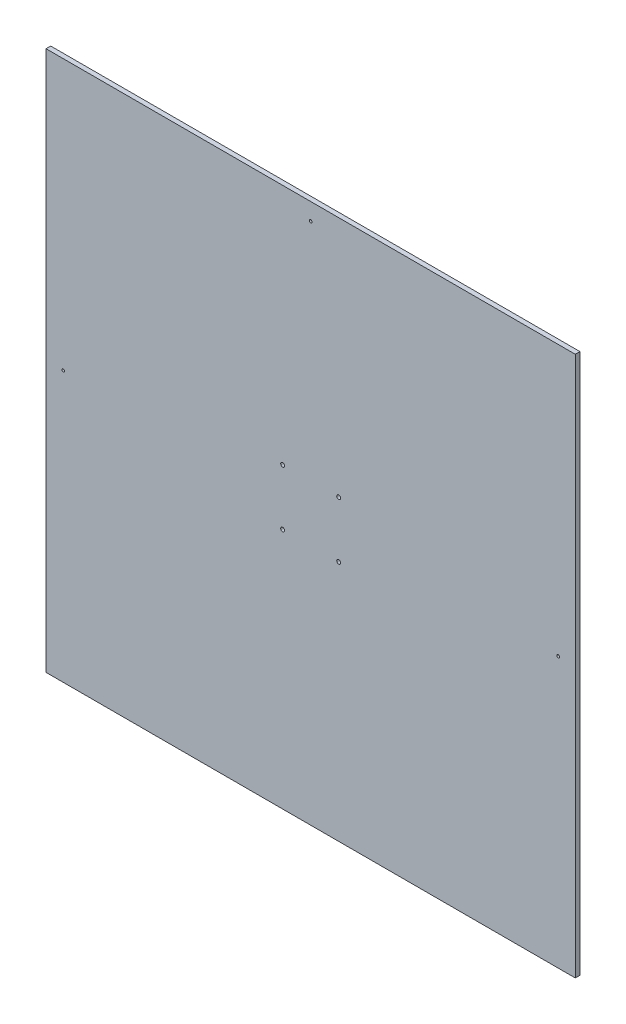
ISO-10303-21;
HEADER;
FILE_DESCRIPTION(('STEP AP214'),'2;1');
FILE_NAME('part.step','',(''),(''),'','','');
FILE_SCHEMA(('AUTOMOTIVE_DESIGN { 1 0 10303 214 1 1 1 1 }'));
ENDSEC;
DATA;
#1=APPLICATION_CONTEXT('core data for automotive mechanical design processes');
#2=APPLICATION_PROTOCOL_DEFINITION('international standard','automotive_design',2000,#1);
#3=PRODUCT_CONTEXT('',#1,'mechanical');
#4=PRODUCT('Part','Part','',(#3));
#5=PRODUCT_RELATED_PRODUCT_CATEGORY('part','',(#4));
#6=PRODUCT_DEFINITION_FORMATION('','',#4);
#7=PRODUCT_DEFINITION_CONTEXT('part definition',#1,'design');
#8=PRODUCT_DEFINITION('design','',#6,#7);
#9=PRODUCT_DEFINITION_SHAPE('','',#8);
#10=(LENGTH_UNIT() NAMED_UNIT(*) SI_UNIT(.MILLI.,.METRE.));
#11=(NAMED_UNIT(*) PLANE_ANGLE_UNIT() SI_UNIT($,.RADIAN.));
#12=(NAMED_UNIT(*) SI_UNIT($,.STERADIAN.) SOLID_ANGLE_UNIT());
#13=UNCERTAINTY_MEASURE_WITH_UNIT(LENGTH_MEASURE(1.E-05),#10,'distance_accuracy_value','');
#14=(GEOMETRIC_REPRESENTATION_CONTEXT(3) GLOBAL_UNCERTAINTY_ASSIGNED_CONTEXT((#13)) GLOBAL_UNIT_ASSIGNED_CONTEXT((#10,
#11,#12)) REPRESENTATION_CONTEXT('',''));
#15=CARTESIAN_POINT('',(0.,0.,0.));
#16=DIRECTION('',(0.,0.,1.));
#17=DIRECTION('',(1.,0.,0.));
#18=AXIS2_PLACEMENT_3D('',#15,#16,#17);
#19=CARTESIAN_POINT('',(0.,0.,6.));
#20=DIRECTION('',(0.,0.,-1.));
#21=DIRECTION('',(-1.,0.,0.));
#22=AXIS2_PLACEMENT_3D('',#19,#20,#21);
#23=PLANE('',#22);
#24=CARTESIAN_POINT('',(-318.,0.,6.));
#25=DIRECTION('',(0.,0.,1.));
#26=DIRECTION('',(1.,0.,0.));
#27=AXIS2_PLACEMENT_3D('',#24,#25,#26);
#28=CIRCLE('',#27,1.74999999999998);
#29=CARTESIAN_POINT('',(-316.25,0.,6.));
#30=VERTEX_POINT('',#29);
#31=EDGE_CURVE('E142',#30,#30,#28,.T.);
#32=ORIENTED_EDGE('',*,*,#31,.F.);
#33=EDGE_LOOP('',(#32));
#34=FACE_BOUND('',#33,.T.);
#35=CARTESIAN_POINT('',(-36.,-36.,6.));
#36=DIRECTION('',(0.,0.,1.));
#37=DIRECTION('',(1.,0.,0.));
#38=AXIS2_PLACEMENT_3D('',#35,#36,#37);
#39=CIRCLE('',#38,2.5);
#40=CARTESIAN_POINT('',(-33.5,-36.,6.));
#41=VERTEX_POINT('',#40);
#42=EDGE_CURVE('E130',#41,#41,#39,.T.);
#43=ORIENTED_EDGE('',*,*,#42,.F.);
#44=EDGE_LOOP('',(#43));
#45=FACE_BOUND('',#44,.T.);
#46=CARTESIAN_POINT('',(0.,325.,6.));
#47=DIRECTION('',(0.,0.,1.));
#48=DIRECTION('',(1.,0.,0.));
#49=AXIS2_PLACEMENT_3D('',#46,#47,#48);
#50=CIRCLE('',#49,1.75);
#51=CARTESIAN_POINT('',(1.75,325.,6.));
#52=VERTEX_POINT('',#51);
#53=EDGE_CURVE('E154',#52,#52,#50,.T.);
#54=ORIENTED_EDGE('',*,*,#53,.F.);
#55=EDGE_LOOP('',(#54));
#56=FACE_BOUND('',#55,.T.);
#57=CARTESIAN_POINT('',(-36.,36.,6.));
#58=DIRECTION('',(0.,0.,1.));
#59=DIRECTION('',(1.,0.,0.));
#60=AXIS2_PLACEMENT_3D('',#57,#58,#59);
#61=CIRCLE('',#60,2.5);
#62=CARTESIAN_POINT('',(-33.5,36.,6.));
#63=VERTEX_POINT('',#62);
#64=EDGE_CURVE('E112',#63,#63,#61,.T.);
#65=ORIENTED_EDGE('',*,*,#64,.F.);
#66=EDGE_LOOP('',(#65));
#67=FACE_BOUND('',#66,.T.);
#68=DIRECTION('',(0.,-1.,0.));
#69=VECTOR('',#68,1.);
#70=CARTESIAN_POINT('',(-340.,347.,6.));
#71=LINE('',#70,#69);
#72=CARTESIAN_POINT('',(-340.,347.,6.));
#73=VERTEX_POINT('',#72);
#74=CARTESIAN_POINT('',(-340.,-347.,6.));
#75=VERTEX_POINT('',#74);
#76=EDGE_CURVE('E97',#73,#75,#71,.T.);
#77=ORIENTED_EDGE('',*,*,#76,.T.);
#78=DIRECTION('',(1.,0.,0.));
#79=VECTOR('',#78,1.);
#80=CARTESIAN_POINT('',(340.,-347.,6.));
#81=LINE('',#80,#79);
#82=CARTESIAN_POINT('',(340.,-347.,6.));
#83=VERTEX_POINT('',#82);
#84=EDGE_CURVE('E92',#75,#83,#81,.T.);
#85=ORIENTED_EDGE('',*,*,#84,.T.);
#86=DIRECTION('',(0.,1.,0.));
#87=VECTOR('',#86,1.);
#88=CARTESIAN_POINT('',(340.,347.,6.));
#89=LINE('',#88,#87);
#90=CARTESIAN_POINT('',(340.,347.,6.));
#91=VERTEX_POINT('',#90);
#92=EDGE_CURVE('E95',#83,#91,#89,.T.);
#93=ORIENTED_EDGE('',*,*,#92,.T.);
#94=DIRECTION('',(-1.,0.,0.));
#95=VECTOR('',#94,1.);
#96=CARTESIAN_POINT('',(340.,347.,6.));
#97=LINE('',#96,#95);
#98=EDGE_CURVE('E62',#91,#73,#97,.T.);
#99=ORIENTED_EDGE('',*,*,#98,.T.);
#100=EDGE_LOOP('',(#77,#85,#93,#99));
#101=FACE_BOUND('',#100,.T.);
#102=CARTESIAN_POINT('',(318.,0.,6.));
#103=DIRECTION('',(0.,0.,-1.));
#104=DIRECTION('',(-1.,0.,0.));
#105=AXIS2_PLACEMENT_3D('',#102,#103,#104);
#106=CIRCLE('',#105,1.74999999999998);
#107=CARTESIAN_POINT('',(316.25,0.,6.));
#108=VERTEX_POINT('',#107);
#109=EDGE_CURVE('E146',#108,#108,#106,.T.);
#110=ORIENTED_EDGE('',*,*,#109,.T.);
#111=EDGE_LOOP('',(#110));
#112=FACE_BOUND('',#111,.T.);
#113=CARTESIAN_POINT('',(36.,36.,6.));
#114=DIRECTION('',(0.,0.,-1.));
#115=DIRECTION('',(-1.,0.,0.));
#116=AXIS2_PLACEMENT_3D('',#113,#114,#115);
#117=CIRCLE('',#116,2.5);
#118=CARTESIAN_POINT('',(33.5,36.,6.));
#119=VERTEX_POINT('',#118);
#120=EDGE_CURVE('E127',#119,#119,#117,.T.);
#121=ORIENTED_EDGE('',*,*,#120,.T.);
#122=EDGE_LOOP('',(#121));
#123=FACE_BOUND('',#122,.T.);
#124=CARTESIAN_POINT('',(36.,-36.,6.));
#125=DIRECTION('',(0.,0.,-1.));
#126=DIRECTION('',(-1.,0.,0.));
#127=AXIS2_PLACEMENT_3D('',#124,#125,#126);
#128=CIRCLE('',#127,2.5);
#129=CARTESIAN_POINT('',(33.5,-36.,6.));
#130=VERTEX_POINT('',#129);
#131=EDGE_CURVE('E134',#130,#130,#128,.T.);
#132=ORIENTED_EDGE('',*,*,#131,.T.);
#133=EDGE_LOOP('',(#132));
#134=FACE_BOUND('',#133,.T.);
#135=ADVANCED_FACE('F45',(#34,#45,#56,#67,#101,#112,#123,#134),#23,.F.);
#136=CARTESIAN_POINT('',(0.,0.,0.));
#137=DIRECTION('',(0.,0.,-1.));
#138=DIRECTION('',(-1.,0.,0.));
#139=AXIS2_PLACEMENT_3D('',#136,#137,#138);
#140=PLANE('',#139);
#141=CARTESIAN_POINT('',(-318.,0.,0.));
#142=DIRECTION('',(0.,0.,-1.));
#143=DIRECTION('',(-1.,0.,0.));
#144=AXIS2_PLACEMENT_3D('',#141,#142,#143);
#145=CIRCLE('',#144,1.74999999999998);
#146=CARTESIAN_POINT('',(-319.75,0.,0.));
#147=VERTEX_POINT('',#146);
#148=EDGE_CURVE('E145',#147,#147,#145,.F.);
#149=ORIENTED_EDGE('',*,*,#148,.T.);
#150=EDGE_LOOP('',(#149));
#151=FACE_BOUND('',#150,.T.);
#152=CARTESIAN_POINT('',(36.,36.,0.));
#153=DIRECTION('',(0.,0.,-1.));
#154=DIRECTION('',(-1.,0.,0.));
#155=AXIS2_PLACEMENT_3D('',#152,#153,#154);
#156=CIRCLE('',#155,2.5);
#157=CARTESIAN_POINT('',(33.5,36.,0.));
#158=VERTEX_POINT('',#157);
#159=EDGE_CURVE('E137',#158,#158,#156,.T.);
#160=ORIENTED_EDGE('',*,*,#159,.F.);
#161=EDGE_LOOP('',(#160));
#162=FACE_BOUND('',#161,.T.);
#163=DIRECTION('',(0.,-1.,0.));
#164=VECTOR('',#163,1.);
#165=CARTESIAN_POINT('',(-340.,347.,0.));
#166=LINE('',#165,#164);
#167=CARTESIAN_POINT('',(-340.,347.,0.));
#168=VERTEX_POINT('',#167);
#169=CARTESIAN_POINT('',(-340.,-347.,0.));
#170=VERTEX_POINT('',#169);
#171=EDGE_CURVE('E109',#168,#170,#166,.T.);
#172=ORIENTED_EDGE('',*,*,#171,.F.);
#173=DIRECTION('',(-1.,0.,0.));
#174=VECTOR('',#173,1.);
#175=CARTESIAN_POINT('',(340.,347.,0.));
#176=LINE('',#175,#174);
#177=CARTESIAN_POINT('',(340.,347.,0.));
#178=VERTEX_POINT('',#177);
#179=EDGE_CURVE('E85',#178,#168,#176,.T.);
#180=ORIENTED_EDGE('',*,*,#179,.F.);
#181=DIRECTION('',(0.,1.,0.));
#182=VECTOR('',#181,1.);
#183=CARTESIAN_POINT('',(340.,347.,0.));
#184=LINE('',#183,#182);
#185=CARTESIAN_POINT('',(340.,-347.,0.));
#186=VERTEX_POINT('',#185);
#187=EDGE_CURVE('E79',#186,#178,#184,.T.);
#188=ORIENTED_EDGE('',*,*,#187,.F.);
#189=DIRECTION('',(1.,0.,0.));
#190=VECTOR('',#189,1.);
#191=CARTESIAN_POINT('',(340.,-347.,0.));
#192=LINE('',#191,#190);
#193=EDGE_CURVE('E101',#170,#186,#192,.T.);
#194=ORIENTED_EDGE('',*,*,#193,.F.);
#195=EDGE_LOOP('',(#172,#180,#188,#194));
#196=FACE_BOUND('',#195,.T.);
#197=CARTESIAN_POINT('',(-36.,36.,0.));
#198=DIRECTION('',(0.,0.,-1.));
#199=DIRECTION('',(-1.,0.,0.));
#200=AXIS2_PLACEMENT_3D('',#197,#198,#199);
#201=CIRCLE('',#200,2.5);
#202=CARTESIAN_POINT('',(-38.5,36.,0.));
#203=VERTEX_POINT('',#202);
#204=EDGE_CURVE('E124',#203,#203,#201,.F.);
#205=ORIENTED_EDGE('',*,*,#204,.T.);
#206=EDGE_LOOP('',(#205));
#207=FACE_BOUND('',#206,.T.);
#208=CARTESIAN_POINT('',(0.,325.,0.));
#209=DIRECTION('',(0.,0.,-1.));
#210=DIRECTION('',(-1.,0.,0.));
#211=AXIS2_PLACEMENT_3D('',#208,#209,#210);
#212=CIRCLE('',#211,1.75);
#213=CARTESIAN_POINT('',(-1.75,325.,0.));
#214=VERTEX_POINT('',#213);
#215=EDGE_CURVE('E157',#214,#214,#212,.F.);
#216=ORIENTED_EDGE('',*,*,#215,.T.);
#217=EDGE_LOOP('',(#216));
#218=FACE_BOUND('',#217,.T.);
#219=CARTESIAN_POINT('',(318.,0.,0.));
#220=DIRECTION('',(0.,0.,-1.));
#221=DIRECTION('',(-1.,0.,0.));
#222=AXIS2_PLACEMENT_3D('',#219,#220,#221);
#223=CIRCLE('',#222,1.74999999999998);
#224=CARTESIAN_POINT('',(316.25,0.,0.));
#225=VERTEX_POINT('',#224);
#226=EDGE_CURVE('E160',#225,#225,#223,.T.);
#227=ORIENTED_EDGE('',*,*,#226,.F.);
#228=EDGE_LOOP('',(#227));
#229=FACE_BOUND('',#228,.T.);
#230=CARTESIAN_POINT('',(-36.,-36.,0.));
#231=DIRECTION('',(0.,0.,-1.));
#232=DIRECTION('',(-1.,0.,0.));
#233=AXIS2_PLACEMENT_3D('',#230,#231,#232);
#234=CIRCLE('',#233,2.5);
#235=CARTESIAN_POINT('',(-38.5,-36.,0.));
#236=VERTEX_POINT('',#235);
#237=EDGE_CURVE('E133',#236,#236,#234,.F.);
#238=ORIENTED_EDGE('',*,*,#237,.T.);
#239=EDGE_LOOP('',(#238));
#240=FACE_BOUND('',#239,.T.);
#241=CARTESIAN_POINT('',(36.,-36.,0.));
#242=DIRECTION('',(0.,0.,-1.));
#243=DIRECTION('',(-1.,0.,0.));
#244=AXIS2_PLACEMENT_3D('',#241,#242,#243);
#245=CIRCLE('',#244,2.5);
#246=CARTESIAN_POINT('',(33.5,-36.,0.));
#247=VERTEX_POINT('',#246);
#248=EDGE_CURVE('E149',#247,#247,#245,.T.);
#249=ORIENTED_EDGE('',*,*,#248,.F.);
#250=EDGE_LOOP('',(#249));
#251=FACE_BOUND('',#250,.T.);
#252=ADVANCED_FACE('F120',(#151,#162,#196,#207,#218,#229,#240,#251),#140,.T.);
#253=CARTESIAN_POINT('',(-340.,347.,6.));
#254=DIRECTION('',(1.,0.,0.));
#255=DIRECTION('',(0.,1.,0.));
#256=AXIS2_PLACEMENT_3D('',#253,#254,#255);
#257=PLANE('',#256);
#258=ORIENTED_EDGE('',*,*,#171,.T.);
#259=DIRECTION('',(0.,0.,-1.));
#260=VECTOR('',#259,1.);
#261=CARTESIAN_POINT('',(-340.,-347.,6.));
#262=LINE('',#261,#260);
#263=EDGE_CURVE('E11',#75,#170,#262,.T.);
#264=ORIENTED_EDGE('',*,*,#263,.F.);
#265=ORIENTED_EDGE('',*,*,#76,.F.);
#266=DIRECTION('',(0.,0.,-1.));
#267=VECTOR('',#266,1.);
#268=CARTESIAN_POINT('',(-340.,347.,6.));
#269=LINE('',#268,#267);
#270=EDGE_CURVE('E105',#73,#168,#269,.T.);
#271=ORIENTED_EDGE('',*,*,#270,.T.);
#272=EDGE_LOOP('',(#258,#264,#265,#271));
#273=FACE_BOUND('',#272,.T.);
#274=ADVANCED_FACE('F47',(#273),#257,.F.);
#275=CARTESIAN_POINT('',(340.,-347.,6.));
#276=DIRECTION('',(0.,1.,0.));
#277=DIRECTION('',(-1.,0.,0.));
#278=AXIS2_PLACEMENT_3D('',#275,#276,#277);
#279=PLANE('',#278);
#280=ORIENTED_EDGE('',*,*,#193,.T.);
#281=DIRECTION('',(0.,0.,-1.));
#282=VECTOR('',#281,1.);
#283=CARTESIAN_POINT('',(340.,-347.,6.));
#284=LINE('',#283,#282);
#285=EDGE_CURVE('E54',#83,#186,#284,.T.);
#286=ORIENTED_EDGE('',*,*,#285,.F.);
#287=ORIENTED_EDGE('',*,*,#84,.F.);
#288=ORIENTED_EDGE('',*,*,#263,.T.);
#289=EDGE_LOOP('',(#280,#286,#287,#288));
#290=FACE_BOUND('',#289,.T.);
#291=ADVANCED_FACE('F100',(#290),#279,.F.);
#292=CARTESIAN_POINT('',(340.,347.,6.));
#293=DIRECTION('',(-1.,0.,0.));
#294=DIRECTION('',(0.,-1.,0.));
#295=AXIS2_PLACEMENT_3D('',#292,#293,#294);
#296=PLANE('',#295);
#297=ORIENTED_EDGE('',*,*,#187,.T.);
#298=DIRECTION('',(0.,0.,-1.));
#299=VECTOR('',#298,1.);
#300=CARTESIAN_POINT('',(340.,347.,6.));
#301=LINE('',#300,#299);
#302=EDGE_CURVE('E102',#91,#178,#301,.T.);
#303=ORIENTED_EDGE('',*,*,#302,.F.);
#304=ORIENTED_EDGE('',*,*,#92,.F.);
#305=ORIENTED_EDGE('',*,*,#285,.T.);
#306=EDGE_LOOP('',(#297,#303,#304,#305));
#307=FACE_BOUND('',#306,.T.);
#308=ADVANCED_FACE('F103',(#307),#296,.F.);
#309=CARTESIAN_POINT('',(340.,347.,6.));
#310=DIRECTION('',(0.,-1.,0.));
#311=DIRECTION('',(1.,0.,0.));
#312=AXIS2_PLACEMENT_3D('',#309,#310,#311);
#313=PLANE('',#312);
#314=ORIENTED_EDGE('',*,*,#179,.T.);
#315=ORIENTED_EDGE('',*,*,#270,.F.);
#316=ORIENTED_EDGE('',*,*,#98,.F.);
#317=ORIENTED_EDGE('',*,*,#302,.T.);
#318=EDGE_LOOP('',(#314,#315,#316,#317));
#319=FACE_BOUND('',#318,.T.);
#320=ADVANCED_FACE('F117',(#319),#313,.F.);
#321=CARTESIAN_POINT('',(-36.,36.,-0.00100000000000013));
#322=DIRECTION('',(0.,0.,1.));
#323=DIRECTION('',(1.,0.,0.));
#324=AXIS2_PLACEMENT_3D('',#321,#322,#323);
#325=CYLINDRICAL_SURFACE('',#324,2.5);
#326=ORIENTED_EDGE('',*,*,#204,.F.);
#327=EDGE_LOOP('',(#326));
#328=FACE_BOUND('',#327,.T.);
#329=ORIENTED_EDGE('',*,*,#64,.T.);
#330=EDGE_LOOP('',(#329));
#331=FACE_BOUND('',#330,.T.);
#332=ADVANCED_FACE('F194',(#328,#331),#325,.F.);
#333=CARTESIAN_POINT('',(0.,325.,-0.00100000000000013));
#334=DIRECTION('',(0.,0.,1.));
#335=DIRECTION('',(1.,0.,0.));
#336=AXIS2_PLACEMENT_3D('',#333,#334,#335);
#337=CYLINDRICAL_SURFACE('',#336,1.75);
#338=ORIENTED_EDGE('',*,*,#215,.F.);
#339=EDGE_LOOP('',(#338));
#340=FACE_BOUND('',#339,.T.);
#341=ORIENTED_EDGE('',*,*,#53,.T.);
#342=EDGE_LOOP('',(#341));
#343=FACE_BOUND('',#342,.T.);
#344=ADVANCED_FACE('F240',(#340,#343),#337,.F.);
#345=CARTESIAN_POINT('',(318.,0.,-0.00100000000000013));
#346=DIRECTION('',(0.,0.,1.));
#347=DIRECTION('',(1.,0.,0.));
#348=AXIS2_PLACEMENT_3D('',#345,#346,#347);
#349=CYLINDRICAL_SURFACE('',#348,1.74999999999998);
#350=ORIENTED_EDGE('',*,*,#226,.T.);
#351=EDGE_LOOP('',(#350));
#352=FACE_BOUND('',#351,.T.);
#353=ORIENTED_EDGE('',*,*,#109,.F.);
#354=EDGE_LOOP('',(#353));
#355=FACE_BOUND('',#354,.T.);
#356=ADVANCED_FACE('F166',(#352,#355),#349,.F.);
#357=CARTESIAN_POINT('',(36.,36.,-0.00100000000000013));
#358=DIRECTION('',(0.,0.,1.));
#359=DIRECTION('',(1.,0.,0.));
#360=AXIS2_PLACEMENT_3D('',#357,#358,#359);
#361=CYLINDRICAL_SURFACE('',#360,2.5);
#362=ORIENTED_EDGE('',*,*,#159,.T.);
#363=EDGE_LOOP('',(#362));
#364=FACE_BOUND('',#363,.T.);
#365=ORIENTED_EDGE('',*,*,#120,.F.);
#366=EDGE_LOOP('',(#365));
#367=FACE_BOUND('',#366,.T.);
#368=ADVANCED_FACE('F258',(#364,#367),#361,.F.);
#369=CARTESIAN_POINT('',(-36.,-36.,-0.00100000000000013));
#370=DIRECTION('',(0.,0.,1.));
#371=DIRECTION('',(1.,0.,0.));
#372=AXIS2_PLACEMENT_3D('',#369,#370,#371);
#373=CYLINDRICAL_SURFACE('',#372,2.5);
#374=ORIENTED_EDGE('',*,*,#237,.F.);
#375=EDGE_LOOP('',(#374));
#376=FACE_BOUND('',#375,.T.);
#377=ORIENTED_EDGE('',*,*,#42,.T.);
#378=EDGE_LOOP('',(#377));
#379=FACE_BOUND('',#378,.T.);
#380=ADVANCED_FACE('F181',(#376,#379),#373,.F.);
#381=CARTESIAN_POINT('',(36.,-36.,-0.00100000000000013));
#382=DIRECTION('',(0.,0.,1.));
#383=DIRECTION('',(1.,0.,0.));
#384=AXIS2_PLACEMENT_3D('',#381,#382,#383);
#385=CYLINDRICAL_SURFACE('',#384,2.5);
#386=ORIENTED_EDGE('',*,*,#248,.T.);
#387=EDGE_LOOP('',(#386));
#388=FACE_BOUND('',#387,.T.);
#389=ORIENTED_EDGE('',*,*,#131,.F.);
#390=EDGE_LOOP('',(#389));
#391=FACE_BOUND('',#390,.T.);
#392=ADVANCED_FACE('F177',(#388,#391),#385,.F.);
#393=CARTESIAN_POINT('',(-318.,0.,-0.00100000000000013));
#394=DIRECTION('',(0.,0.,1.));
#395=DIRECTION('',(1.,0.,0.));
#396=AXIS2_PLACEMENT_3D('',#393,#394,#395);
#397=CYLINDRICAL_SURFACE('',#396,1.74999999999998);
#398=ORIENTED_EDGE('',*,*,#148,.F.);
#399=EDGE_LOOP('',(#398));
#400=FACE_BOUND('',#399,.T.);
#401=ORIENTED_EDGE('',*,*,#31,.T.);
#402=EDGE_LOOP('',(#401));
#403=FACE_BOUND('',#402,.T.);
#404=ADVANCED_FACE('F180',(#400,#403),#397,.F.);
#405=CLOSED_SHELL('',(#135,#252,#274,#291,#308,#320,#332,#344,#356,#368,#380,#392,#404));
#406=MANIFOLD_SOLID_BREP('B2',#405);
#407=ADVANCED_BREP_SHAPE_REPRESENTATION('',(#18,#406),#14);
#408=SHAPE_DEFINITION_REPRESENTATION(#9,#407);
ENDSEC;
END-ISO-10303-21;
